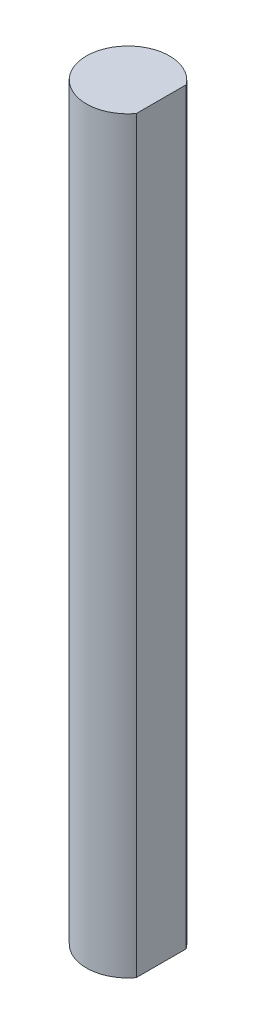
ISO-10303-21;
HEADER;
FILE_DESCRIPTION(('STEP AP214'),'2;1');
FILE_NAME('part.step','',(''),(''),'','','');
FILE_SCHEMA(('AUTOMOTIVE_DESIGN { 1 0 10303 214 1 1 1 1 }'));
ENDSEC;
DATA;
#1=APPLICATION_CONTEXT('core data for automotive mechanical design processes');
#2=APPLICATION_PROTOCOL_DEFINITION('international standard','automotive_design',2000,#1);
#3=PRODUCT_CONTEXT('',#1,'mechanical');
#4=PRODUCT('Part','Part','',(#3));
#5=PRODUCT_RELATED_PRODUCT_CATEGORY('part','',(#4));
#6=PRODUCT_DEFINITION_FORMATION('','',#4);
#7=PRODUCT_DEFINITION_CONTEXT('part definition',#1,'design');
#8=PRODUCT_DEFINITION('design','',#6,#7);
#9=PRODUCT_DEFINITION_SHAPE('','',#8);
#10=(LENGTH_UNIT() NAMED_UNIT(*) SI_UNIT(.MILLI.,.METRE.));
#11=(NAMED_UNIT(*) PLANE_ANGLE_UNIT() SI_UNIT($,.RADIAN.));
#12=(NAMED_UNIT(*) SI_UNIT($,.STERADIAN.) SOLID_ANGLE_UNIT());
#13=UNCERTAINTY_MEASURE_WITH_UNIT(LENGTH_MEASURE(1.E-05),#10,'distance_accuracy_value','');
#14=(GEOMETRIC_REPRESENTATION_CONTEXT(3) GLOBAL_UNCERTAINTY_ASSIGNED_CONTEXT((#13)) GLOBAL_UNIT_ASSIGNED_CONTEXT((#10,
#11,#12)) REPRESENTATION_CONTEXT('',''));
#15=CARTESIAN_POINT('',(0.,0.,0.));
#16=DIRECTION('',(0.,0.,1.));
#17=DIRECTION('',(1.,0.,0.));
#18=AXIS2_PLACEMENT_3D('',#15,#16,#17);
#19=CARTESIAN_POINT('',(0.,57.15,0.));
#20=DIRECTION('',(0.,-1.,0.));
#21=DIRECTION('',(0.,0.,-1.));
#22=AXIS2_PLACEMENT_3D('',#19,#20,#21);
#23=CYLINDRICAL_SURFACE('',#22,3.175);
#24=CARTESIAN_POINT('',(0.,0.,0.));
#25=DIRECTION('',(0.,1.,0.));
#26=DIRECTION('',(0.,0.,1.));
#27=AXIS2_PLACEMENT_3D('',#24,#25,#26);
#28=CIRCLE('',#27,3.175);
#29=CARTESIAN_POINT('',(2.54,0.,-1.905));
#30=VERTEX_POINT('',#29);
#31=CARTESIAN_POINT('',(2.54,0.,1.905));
#32=VERTEX_POINT('',#31);
#33=EDGE_CURVE('E62',#30,#32,#28,.T.);
#34=ORIENTED_EDGE('',*,*,#33,.T.);
#35=DIRECTION('',(0.,-1.,0.));
#36=VECTOR('',#35,1.);
#37=CARTESIAN_POINT('',(2.54,57.15,1.905));
#38=LINE('',#37,#36);
#39=CARTESIAN_POINT('',(2.54,57.15,1.905));
#40=VERTEX_POINT('',#39);
#41=EDGE_CURVE('E11',#40,#32,#38,.T.);
#42=ORIENTED_EDGE('',*,*,#41,.F.);
#43=CARTESIAN_POINT('',(0.,57.15,0.));
#44=DIRECTION('',(0.,1.,0.));
#45=DIRECTION('',(0.,0.,1.));
#46=AXIS2_PLACEMENT_3D('',#43,#44,#45);
#47=CIRCLE('',#46,3.175);
#48=CARTESIAN_POINT('',(2.54,57.15,-1.905));
#49=VERTEX_POINT('',#48);
#50=EDGE_CURVE('E64',#49,#40,#47,.T.);
#51=ORIENTED_EDGE('',*,*,#50,.F.);
#52=DIRECTION('',(0.,-1.,0.));
#53=VECTOR('',#52,1.);
#54=CARTESIAN_POINT('',(2.54,57.15,-1.905));
#55=LINE('',#54,#53);
#56=EDGE_CURVE('E46',#49,#30,#55,.T.);
#57=ORIENTED_EDGE('',*,*,#56,.T.);
#58=EDGE_LOOP('',(#34,#42,#51,#57));
#59=FACE_BOUND('',#58,.T.);
#60=ADVANCED_FACE('F38',(#59),#23,.T.);
#61=CARTESIAN_POINT('',(2.54,57.15,0.));
#62=DIRECTION('',(1.,0.,0.));
#63=DIRECTION('',(0.,0.,-1.));
#64=AXIS2_PLACEMENT_3D('',#61,#62,#63);
#65=PLANE('',#64);
#66=DIRECTION('',(0.,0.,1.));
#67=VECTOR('',#66,1.);
#68=CARTESIAN_POINT('',(2.54,0.,0.));
#69=LINE('',#68,#67);
#70=EDGE_CURVE('E69',#30,#32,#69,.T.);
#71=ORIENTED_EDGE('',*,*,#70,.F.);
#72=ORIENTED_EDGE('',*,*,#56,.F.);
#73=DIRECTION('',(0.,0.,1.));
#74=VECTOR('',#73,1.);
#75=CARTESIAN_POINT('',(2.54,57.15,0.));
#76=LINE('',#75,#74);
#77=EDGE_CURVE('E66',#49,#40,#76,.T.);
#78=ORIENTED_EDGE('',*,*,#77,.T.);
#79=ORIENTED_EDGE('',*,*,#41,.T.);
#80=EDGE_LOOP('',(#71,#72,#78,#79));
#81=FACE_BOUND('',#80,.T.);
#82=ADVANCED_FACE('F71',(#81),#65,.T.);
#83=CARTESIAN_POINT('',(0.,57.15,0.));
#84=DIRECTION('',(0.,1.,0.));
#85=DIRECTION('',(0.,0.,1.));
#86=AXIS2_PLACEMENT_3D('',#83,#84,#85);
#87=PLANE('',#86);
#88=ORIENTED_EDGE('',*,*,#50,.T.);
#89=ORIENTED_EDGE('',*,*,#77,.F.);
#90=EDGE_LOOP('',(#88,#89));
#91=FACE_BOUND('',#90,.T.);
#92=ADVANCED_FACE('F76',(#91),#87,.T.);
#93=CARTESIAN_POINT('',(0.,0.,0.));
#94=DIRECTION('',(0.,1.,0.));
#95=DIRECTION('',(0.,0.,1.));
#96=AXIS2_PLACEMENT_3D('',#93,#94,#95);
#97=PLANE('',#96);
#98=ORIENTED_EDGE('',*,*,#33,.F.);
#99=ORIENTED_EDGE('',*,*,#70,.T.);
#100=EDGE_LOOP('',(#98,#99));
#101=FACE_BOUND('',#100,.T.);
#102=ADVANCED_FACE('F68',(#101),#97,.F.);
#103=CLOSED_SHELL('',(#60,#82,#92,#102));
#104=MANIFOLD_SOLID_BREP('B2',#103);
#105=ADVANCED_BREP_SHAPE_REPRESENTATION('',(#18,#104),#14);
#106=SHAPE_DEFINITION_REPRESENTATION(#9,#105);
ENDSEC;
END-ISO-10303-21;
